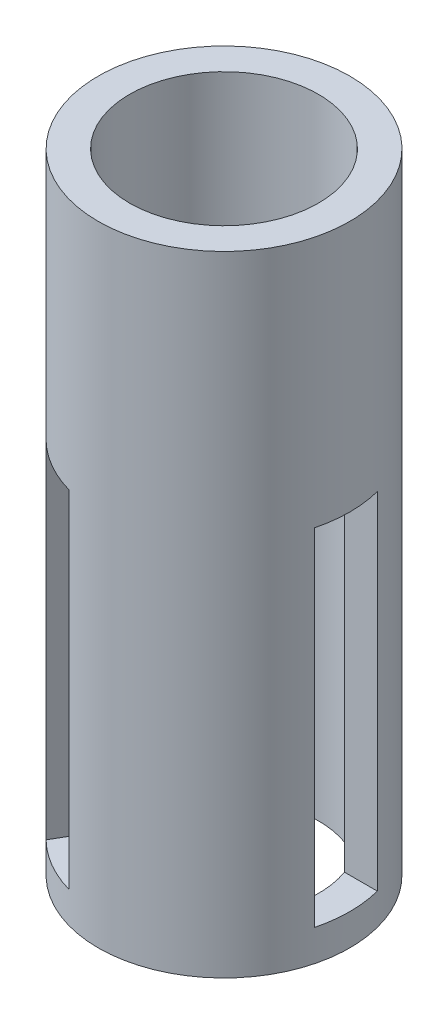
ISO-10303-21;
HEADER;
FILE_DESCRIPTION(('STEP AP214'),'2;1');
FILE_NAME('part.step','',(''),(''),'','','');
FILE_SCHEMA(('AUTOMOTIVE_DESIGN { 1 0 10303 214 1 1 1 1 }'));
ENDSEC;
DATA;
#1=APPLICATION_CONTEXT('core data for automotive mechanical design processes');
#2=APPLICATION_PROTOCOL_DEFINITION('international standard','automotive_design',2000,#1);
#3=PRODUCT_CONTEXT('',#1,'mechanical');
#4=PRODUCT('Part','Part','',(#3));
#5=PRODUCT_RELATED_PRODUCT_CATEGORY('part','',(#4));
#6=PRODUCT_DEFINITION_FORMATION('','',#4);
#7=PRODUCT_DEFINITION_CONTEXT('part definition',#1,'design');
#8=PRODUCT_DEFINITION('design','',#6,#7);
#9=PRODUCT_DEFINITION_SHAPE('','',#8);
#10=(LENGTH_UNIT() NAMED_UNIT(*) SI_UNIT(.MILLI.,.METRE.));
#11=(NAMED_UNIT(*) PLANE_ANGLE_UNIT() SI_UNIT($,.RADIAN.));
#12=(NAMED_UNIT(*) SI_UNIT($,.STERADIAN.) SOLID_ANGLE_UNIT());
#13=UNCERTAINTY_MEASURE_WITH_UNIT(LENGTH_MEASURE(1.E-05),#10,'distance_accuracy_value','');
#14=(GEOMETRIC_REPRESENTATION_CONTEXT(3) GLOBAL_UNCERTAINTY_ASSIGNED_CONTEXT((#13)) GLOBAL_UNIT_ASSIGNED_CONTEXT((#10,
#11,#12)) REPRESENTATION_CONTEXT('',''));
#15=CARTESIAN_POINT('',(0.,0.,0.));
#16=DIRECTION('',(0.,0.,1.));
#17=DIRECTION('',(1.,0.,0.));
#18=AXIS2_PLACEMENT_3D('',#15,#16,#17);
#19=CARTESIAN_POINT('',(0.,100.,0.));
#20=DIRECTION('',(0.,1.,0.));
#21=DIRECTION('',(0.,0.,1.));
#22=AXIS2_PLACEMENT_3D('',#19,#20,#21);
#23=PLANE('',#22);
#24=CARTESIAN_POINT('',(0.,100.,0.));
#25=DIRECTION('',(0.,1.,0.));
#26=DIRECTION('',(0.,0.,1.));
#27=AXIS2_PLACEMENT_3D('',#24,#25,#26);
#28=CIRCLE('',#27,20.);
#29=CARTESIAN_POINT('',(0.,100.,20.));
#30=VERTEX_POINT('',#29);
#31=EDGE_CURVE('E11',#30,#30,#28,.T.);
#32=ORIENTED_EDGE('',*,*,#31,.T.);
#33=EDGE_LOOP('',(#32));
#34=FACE_BOUND('',#33,.T.);
#35=CARTESIAN_POINT('',(0.,100.,0.));
#36=DIRECTION('',(0.,1.,0.));
#37=DIRECTION('',(0.,0.,1.));
#38=AXIS2_PLACEMENT_3D('',#35,#36,#37);
#39=CIRCLE('',#38,15.);
#40=CARTESIAN_POINT('',(0.,100.,15.));
#41=VERTEX_POINT('',#40);
#42=EDGE_CURVE('E274',#41,#41,#39,.T.);
#43=ORIENTED_EDGE('',*,*,#42,.F.);
#44=EDGE_LOOP('',(#43));
#45=FACE_BOUND('',#44,.T.);
#46=ADVANCED_FACE('F41',(#34,#45),#23,.T.);
#47=CARTESIAN_POINT('',(0.,0.,0.));
#48=DIRECTION('',(0.,1.,0.));
#49=DIRECTION('',(0.,0.,1.));
#50=AXIS2_PLACEMENT_3D('',#47,#48,#49);
#51=PLANE('',#50);
#52=CARTESIAN_POINT('',(0.,0.,0.));
#53=DIRECTION('',(0.,1.,0.));
#54=DIRECTION('',(0.,0.,1.));
#55=AXIS2_PLACEMENT_3D('',#52,#53,#54);
#56=CIRCLE('',#55,20.);
#57=CARTESIAN_POINT('',(0.,0.,20.));
#58=VERTEX_POINT('',#57);
#59=EDGE_CURVE('E45',#58,#58,#56,.T.);
#60=ORIENTED_EDGE('',*,*,#59,.F.);
#61=EDGE_LOOP('',(#60));
#62=FACE_BOUND('',#61,.T.);
#63=CARTESIAN_POINT('',(0.,0.,0.));
#64=DIRECTION('',(0.,1.,0.));
#65=DIRECTION('',(0.,0.,1.));
#66=AXIS2_PLACEMENT_3D('',#63,#64,#65);
#67=CIRCLE('',#66,15.);
#68=CARTESIAN_POINT('',(0.,0.,15.));
#69=VERTEX_POINT('',#68);
#70=EDGE_CURVE('E273',#69,#69,#67,.T.);
#71=ORIENTED_EDGE('',*,*,#70,.T.);
#72=EDGE_LOOP('',(#71));
#73=FACE_BOUND('',#72,.T.);
#74=ADVANCED_FACE('F282',(#62,#73),#51,.F.);
#75=CARTESIAN_POINT('',(0.,100.,0.));
#76=DIRECTION('',(0.,-1.,0.));
#77=DIRECTION('',(0.,0.,-1.));
#78=AXIS2_PLACEMENT_3D('',#75,#76,#77);
#79=CYLINDRICAL_SURFACE('',#78,20.);
#80=CARTESIAN_POINT('',(0.,60.,0.));
#81=DIRECTION('',(0.,1.,0.));
#82=DIRECTION('',(0.,0.,1.));
#83=AXIS2_PLACEMENT_3D('',#80,#81,#82);
#84=CIRCLE('',#83,20.);
#85=CARTESIAN_POINT('',(-14.0125853844408,60.,14.2705098312484));
#86=VERTEX_POINT('',#85);
#87=CARTESIAN_POINT('',(-5.35233134659644,60.,19.2705098312484));
#88=VERTEX_POINT('',#87);
#89=EDGE_CURVE('E220',#86,#88,#84,.T.);
#90=ORIENTED_EDGE('',*,*,#89,.T.);
#91=DIRECTION('',(0.,-1.,0.));
#92=VECTOR('',#91,1.);
#93=CARTESIAN_POINT('',(-5.35233134659644,100.,19.2705098312484));
#94=LINE('',#93,#92);
#95=CARTESIAN_POINT('',(-5.35233134659644,5.,19.2705098312484));
#96=VERTEX_POINT('',#95);
#97=EDGE_CURVE('E223',#88,#96,#94,.T.);
#98=ORIENTED_EDGE('',*,*,#97,.T.);
#99=CARTESIAN_POINT('',(0.,5.,0.));
#100=DIRECTION('',(0.,-1.,0.));
#101=DIRECTION('',(1.,0.,0.));
#102=AXIS2_PLACEMENT_3D('',#99,#100,#101);
#103=CIRCLE('',#102,20.);
#104=CARTESIAN_POINT('',(-14.0125853844408,5.,14.2705098312484));
#105=VERTEX_POINT('',#104);
#106=EDGE_CURVE('E153',#96,#105,#103,.T.);
#107=ORIENTED_EDGE('',*,*,#106,.T.);
#108=DIRECTION('',(0.,-1.,0.));
#109=VECTOR('',#108,1.);
#110=CARTESIAN_POINT('',(-14.0125853844408,100.,14.2705098312484));
#111=LINE('',#110,#109);
#112=EDGE_CURVE('E216',#105,#86,#111,.F.);
#113=ORIENTED_EDGE('',*,*,#112,.T.);
#114=EDGE_LOOP('',(#90,#98,#107,#113));
#115=FACE_BOUND('',#114,.T.);
#116=DIRECTION('',(0.,-1.,0.));
#117=VECTOR('',#116,1.);
#118=CARTESIAN_POINT('',(-14.0125853844406,100.,-14.2705098312486));
#119=LINE('',#118,#117);
#120=CARTESIAN_POINT('',(-14.0125853844406,60.,-14.2705098312485));
#121=VERTEX_POINT('',#120);
#122=CARTESIAN_POINT('',(-14.0125853844406,5.,-14.2705098312486));
#123=VERTEX_POINT('',#122);
#124=EDGE_CURVE('E207',#121,#123,#119,.T.);
#125=ORIENTED_EDGE('',*,*,#124,.T.);
#126=CARTESIAN_POINT('',(0.,5.,0.));
#127=DIRECTION('',(0.,-1.,0.));
#128=DIRECTION('',(1.,0.,0.));
#129=AXIS2_PLACEMENT_3D('',#126,#127,#128);
#130=CIRCLE('',#129,20.);
#131=CARTESIAN_POINT('',(-5.35233134659616,5.,-19.2705098312485));
#132=VERTEX_POINT('',#131);
#133=EDGE_CURVE('E65',#123,#132,#130,.T.);
#134=ORIENTED_EDGE('',*,*,#133,.T.);
#135=DIRECTION('',(0.,-1.,0.));
#136=VECTOR('',#135,1.);
#137=CARTESIAN_POINT('',(-5.35233134659617,100.,-19.2705098312485));
#138=LINE('',#137,#136);
#139=CARTESIAN_POINT('',(-5.35233134659617,60.,-19.2705098312485));
#140=VERTEX_POINT('',#139);
#141=EDGE_CURVE('E213',#132,#140,#138,.F.);
#142=ORIENTED_EDGE('',*,*,#141,.T.);
#143=CARTESIAN_POINT('',(0.,60.,0.));
#144=DIRECTION('',(0.,1.,0.));
#145=DIRECTION('',(0.,0.,1.));
#146=AXIS2_PLACEMENT_3D('',#143,#144,#145);
#147=CIRCLE('',#146,20.);
#148=EDGE_CURVE('E210',#140,#121,#147,.T.);
#149=ORIENTED_EDGE('',*,*,#148,.T.);
#150=EDGE_LOOP('',(#125,#134,#142,#149));
#151=FACE_BOUND('',#150,.T.);
#152=CARTESIAN_POINT('',(0.,60.,0.));
#153=DIRECTION('',(0.,1.,0.));
#154=DIRECTION('',(0.,0.,1.));
#155=AXIS2_PLACEMENT_3D('',#152,#153,#154);
#156=CIRCLE('',#155,20.);
#157=CARTESIAN_POINT('',(19.3649167310371,60.,5.));
#158=VERTEX_POINT('',#157);
#159=CARTESIAN_POINT('',(19.3649167310371,60.,-5.));
#160=VERTEX_POINT('',#159);
#161=EDGE_CURVE('E263',#158,#160,#156,.T.);
#162=ORIENTED_EDGE('',*,*,#161,.T.);
#163=DIRECTION('',(0.,-1.,0.));
#164=VECTOR('',#163,1.);
#165=CARTESIAN_POINT('',(19.3649167310371,100.,-5.));
#166=LINE('',#165,#164);
#167=CARTESIAN_POINT('',(19.3649167310371,5.,-4.99999999999999));
#168=VERTEX_POINT('',#167);
#169=EDGE_CURVE('E266',#160,#168,#166,.T.);
#170=ORIENTED_EDGE('',*,*,#169,.T.);
#171=CARTESIAN_POINT('',(0.,5.,0.));
#172=DIRECTION('',(0.,-1.,0.));
#173=DIRECTION('',(0.,0.,-1.));
#174=AXIS2_PLACEMENT_3D('',#171,#172,#173);
#175=CIRCLE('',#174,20.);
#176=CARTESIAN_POINT('',(19.3649167310371,5.,5.00000000000001));
#177=VERTEX_POINT('',#176);
#178=EDGE_CURVE('E270',#168,#177,#175,.T.);
#179=ORIENTED_EDGE('',*,*,#178,.T.);
#180=DIRECTION('',(0.,-1.,0.));
#181=VECTOR('',#180,1.);
#182=CARTESIAN_POINT('',(19.3649167310371,100.,5.));
#183=LINE('',#182,#181);
#184=EDGE_CURVE('E251',#177,#158,#183,.F.);
#185=ORIENTED_EDGE('',*,*,#184,.T.);
#186=EDGE_LOOP('',(#162,#170,#179,#185));
#187=FACE_BOUND('',#186,.T.);
#188=ORIENTED_EDGE('',*,*,#31,.F.);
#189=EDGE_LOOP('',(#188));
#190=FACE_BOUND('',#189,.T.);
#191=ORIENTED_EDGE('',*,*,#59,.T.);
#192=EDGE_LOOP('',(#191));
#193=FACE_BOUND('',#192,.T.);
#194=ADVANCED_FACE('F43',(#115,#151,#187,#190,#193),#79,.T.);
#195=CARTESIAN_POINT('',(0.,100.,0.));
#196=DIRECTION('',(0.,-1.,0.));
#197=DIRECTION('',(0.,0.,-1.));
#198=AXIS2_PLACEMENT_3D('',#195,#196,#197);
#199=CYLINDRICAL_SURFACE('',#198,15.);
#200=CARTESIAN_POINT('',(0.,5.,0.));
#201=DIRECTION('',(0.,-1.,0.));
#202=DIRECTION('',(1.,0.,0.));
#203=AXIS2_PLACEMENT_3D('',#200,#201,#202);
#204=CIRCLE('',#203,15.);
#205=CARTESIAN_POINT('',(-11.4011948307877,5.,9.74744871391584));
#206=VERTEX_POINT('',#205);
#207=CARTESIAN_POINT('',(-2.74094079294335,5.,14.7474487139159));
#208=VERTEX_POINT('',#207);
#209=EDGE_CURVE('E151',#206,#208,#204,.F.);
#210=ORIENTED_EDGE('',*,*,#209,.T.);
#211=DIRECTION('',(0.,-1.,0.));
#212=VECTOR('',#211,1.);
#213=CARTESIAN_POINT('',(-2.74094079294335,100.,14.7474487139159));
#214=LINE('',#213,#212);
#215=CARTESIAN_POINT('',(-2.74094079294335,60.,14.7474487139159));
#216=VERTEX_POINT('',#215);
#217=EDGE_CURVE('E134',#208,#216,#214,.F.);
#218=ORIENTED_EDGE('',*,*,#217,.T.);
#219=CARTESIAN_POINT('',(0.,60.,0.));
#220=DIRECTION('',(0.,1.,0.));
#221=DIRECTION('',(0.,0.,1.));
#222=AXIS2_PLACEMENT_3D('',#219,#220,#221);
#223=CIRCLE('',#222,15.);
#224=CARTESIAN_POINT('',(-11.4011948307877,60.,9.74744871391584));
#225=VERTEX_POINT('',#224);
#226=EDGE_CURVE('E170',#216,#225,#223,.F.);
#227=ORIENTED_EDGE('',*,*,#226,.T.);
#228=DIRECTION('',(0.,-1.,0.));
#229=VECTOR('',#228,1.);
#230=CARTESIAN_POINT('',(-11.4011948307877,100.,9.74744871391584));
#231=LINE('',#230,#229);
#232=EDGE_CURVE('E158',#225,#206,#231,.T.);
#233=ORIENTED_EDGE('',*,*,#232,.T.);
#234=EDGE_LOOP('',(#210,#218,#227,#233));
#235=FACE_BOUND('',#234,.T.);
#236=DIRECTION('',(0.,-1.,0.));
#237=VECTOR('',#236,1.);
#238=CARTESIAN_POINT('',(-2.74094079294314,100.,-14.7474487139159));
#239=LINE('',#238,#237);
#240=CARTESIAN_POINT('',(-2.74094079294314,60.,-14.7474487139159));
#241=VERTEX_POINT('',#240);
#242=CARTESIAN_POINT('',(-2.74094079294314,5.,-14.7474487139159));
#243=VERTEX_POINT('',#242);
#244=EDGE_CURVE('E179',#241,#243,#239,.T.);
#245=ORIENTED_EDGE('',*,*,#244,.T.);
#246=CARTESIAN_POINT('',(0.,5.,0.));
#247=DIRECTION('',(0.,-1.,0.));
#248=DIRECTION('',(1.,0.,0.));
#249=AXIS2_PLACEMENT_3D('',#246,#247,#248);
#250=CIRCLE('',#249,15.);
#251=CARTESIAN_POINT('',(-11.4011948307876,5.,-9.747448713916));
#252=VERTEX_POINT('',#251);
#253=EDGE_CURVE('E164',#243,#252,#250,.F.);
#254=ORIENTED_EDGE('',*,*,#253,.T.);
#255=DIRECTION('',(0.,-1.,0.));
#256=VECTOR('',#255,1.);
#257=CARTESIAN_POINT('',(-11.4011948307876,100.,-9.747448713916));
#258=LINE('',#257,#256);
#259=CARTESIAN_POINT('',(-11.4011948307876,60.,-9.747448713916));
#260=VERTEX_POINT('',#259);
#261=EDGE_CURVE('E184',#252,#260,#258,.F.);
#262=ORIENTED_EDGE('',*,*,#261,.T.);
#263=CARTESIAN_POINT('',(0.,60.,0.));
#264=DIRECTION('',(0.,1.,0.));
#265=DIRECTION('',(0.,0.,1.));
#266=AXIS2_PLACEMENT_3D('',#263,#264,#265);
#267=CIRCLE('',#266,15.);
#268=EDGE_CURVE('E192',#260,#241,#267,.F.);
#269=ORIENTED_EDGE('',*,*,#268,.T.);
#270=EDGE_LOOP('',(#245,#254,#262,#269));
#271=FACE_BOUND('',#270,.T.);
#272=CARTESIAN_POINT('',(0.,5.,0.));
#273=DIRECTION('',(0.,-1.,0.));
#274=DIRECTION('',(0.,0.,-1.));
#275=AXIS2_PLACEMENT_3D('',#272,#273,#274);
#276=CIRCLE('',#275,15.);
#277=CARTESIAN_POINT('',(14.142135623731,5.,5.));
#278=VERTEX_POINT('',#277);
#279=CARTESIAN_POINT('',(14.142135623731,5.,-4.99999999999999));
#280=VERTEX_POINT('',#279);
#281=EDGE_CURVE('E228',#278,#280,#276,.F.);
#282=ORIENTED_EDGE('',*,*,#281,.T.);
#283=DIRECTION('',(0.,-1.,0.));
#284=VECTOR('',#283,1.);
#285=CARTESIAN_POINT('',(14.142135623731,100.,-5.));
#286=LINE('',#285,#284);
#287=CARTESIAN_POINT('',(14.142135623731,60.,-5.));
#288=VERTEX_POINT('',#287);
#289=EDGE_CURVE('E244',#280,#288,#286,.F.);
#290=ORIENTED_EDGE('',*,*,#289,.T.);
#291=CARTESIAN_POINT('',(0.,60.,0.));
#292=DIRECTION('',(0.,1.,0.));
#293=DIRECTION('',(0.,0.,1.));
#294=AXIS2_PLACEMENT_3D('',#291,#292,#293);
#295=CIRCLE('',#294,15.);
#296=CARTESIAN_POINT('',(14.1421356237309,60.,5.));
#297=VERTEX_POINT('',#296);
#298=EDGE_CURVE('E239',#288,#297,#295,.F.);
#299=ORIENTED_EDGE('',*,*,#298,.T.);
#300=DIRECTION('',(0.,-1.,0.));
#301=VECTOR('',#300,1.);
#302=CARTESIAN_POINT('',(14.142135623731,100.,5.));
#303=LINE('',#302,#301);
#304=EDGE_CURVE('E233',#297,#278,#303,.T.);
#305=ORIENTED_EDGE('',*,*,#304,.T.);
#306=EDGE_LOOP('',(#282,#290,#299,#305));
#307=FACE_BOUND('',#306,.T.);
#308=ORIENTED_EDGE('',*,*,#42,.T.);
#309=EDGE_LOOP('',(#308));
#310=FACE_BOUND('',#309,.T.);
#311=ORIENTED_EDGE('',*,*,#70,.F.);
#312=EDGE_LOOP('',(#311));
#313=FACE_BOUND('',#312,.T.);
#314=ADVANCED_FACE('F156',(#235,#271,#307,#310,#313),#199,.F.);
#315=CARTESIAN_POINT('',(-20.001,5.,-4.99999999999999));
#316=DIRECTION('',(0.,-1.,0.));
#317=DIRECTION('',(0.,0.,-1.));
#318=AXIS2_PLACEMENT_3D('',#315,#316,#317);
#319=PLANE('',#318);
#320=DIRECTION('',(1.,0.,0.));
#321=VECTOR('',#320,1.);
#322=CARTESIAN_POINT('',(-20.001,5.,-4.99999999999999));
#323=LINE('',#322,#321);
#324=EDGE_CURVE('E232',#280,#168,#323,.T.);
#325=ORIENTED_EDGE('',*,*,#324,.F.);
#326=ORIENTED_EDGE('',*,*,#281,.F.);
#327=DIRECTION('',(1.,0.,0.));
#328=VECTOR('',#327,1.);
#329=CARTESIAN_POINT('',(-20.001,5.,5.00000000000001));
#330=LINE('',#329,#328);
#331=EDGE_CURVE('E237',#278,#177,#330,.T.);
#332=ORIENTED_EDGE('',*,*,#331,.T.);
#333=ORIENTED_EDGE('',*,*,#178,.F.);
#334=EDGE_LOOP('',(#325,#326,#332,#333));
#335=FACE_BOUND('',#334,.T.);
#336=ADVANCED_FACE('F285',(#335),#319,.F.);
#337=CARTESIAN_POINT('',(-20.001,5.,-4.99999999999999));
#338=DIRECTION('',(0.,0.,-1.));
#339=DIRECTION('',(0.,1.,0.));
#340=AXIS2_PLACEMENT_3D('',#337,#338,#339);
#341=PLANE('',#340);
#342=DIRECTION('',(1.,0.,0.));
#343=VECTOR('',#342,1.);
#344=CARTESIAN_POINT('',(-20.001,60.,-5.));
#345=LINE('',#344,#343);
#346=EDGE_CURVE('E243',#288,#160,#345,.T.);
#347=ORIENTED_EDGE('',*,*,#346,.F.);
#348=ORIENTED_EDGE('',*,*,#289,.F.);
#349=ORIENTED_EDGE('',*,*,#324,.T.);
#350=ORIENTED_EDGE('',*,*,#169,.F.);
#351=EDGE_LOOP('',(#347,#348,#349,#350));
#352=FACE_BOUND('',#351,.T.);
#353=ADVANCED_FACE('F291',(#352),#341,.F.);
#354=CARTESIAN_POINT('',(-20.001,60.,-5.));
#355=DIRECTION('',(0.,1.,0.));
#356=DIRECTION('',(0.,0.,1.));
#357=AXIS2_PLACEMENT_3D('',#354,#355,#356);
#358=PLANE('',#357);
#359=DIRECTION('',(1.,0.,0.));
#360=VECTOR('',#359,1.);
#361=CARTESIAN_POINT('',(-20.001,60.,5.));
#362=LINE('',#361,#360);
#363=EDGE_CURVE('E238',#297,#158,#362,.T.);
#364=ORIENTED_EDGE('',*,*,#363,.F.);
#365=ORIENTED_EDGE('',*,*,#298,.F.);
#366=ORIENTED_EDGE('',*,*,#346,.T.);
#367=ORIENTED_EDGE('',*,*,#161,.F.);
#368=EDGE_LOOP('',(#364,#365,#366,#367));
#369=FACE_BOUND('',#368,.T.);
#370=ADVANCED_FACE('F411',(#369),#358,.F.);
#371=CARTESIAN_POINT('',(-20.001,5.,5.00000000000001));
#372=DIRECTION('',(0.,0.,1.));
#373=DIRECTION('',(0.,-1.,0.));
#374=AXIS2_PLACEMENT_3D('',#371,#372,#373);
#375=PLANE('',#374);
#376=ORIENTED_EDGE('',*,*,#331,.F.);
#377=ORIENTED_EDGE('',*,*,#304,.F.);
#378=ORIENTED_EDGE('',*,*,#363,.T.);
#379=ORIENTED_EDGE('',*,*,#184,.F.);
#380=EDGE_LOOP('',(#376,#377,#378,#379));
#381=FACE_BOUND('',#380,.T.);
#382=ADVANCED_FACE('F325',(#381),#375,.F.);
#383=CARTESIAN_POINT('',(17.9910640694683,5.,21.1614370505464));
#384=DIRECTION('',(0.866025403784443,0.,-0.499999999999992));
#385=DIRECTION('',(-0.499999999999992,0.,-0.866025403784443));
#386=AXIS2_PLACEMENT_3D('',#383,#384,#385);
#387=PLANE('',#386);
#388=DIRECTION('',(-0.499999999999992,0.,-0.866025403784443));
#389=VECTOR('',#388,1.);
#390=CARTESIAN_POINT('',(17.9910640694683,5.,21.1614370505464));
#391=LINE('',#390,#389);
#392=EDGE_CURVE('E183',#243,#132,#391,.T.);
#393=ORIENTED_EDGE('',*,*,#392,.F.);
#394=ORIENTED_EDGE('',*,*,#244,.F.);
#395=DIRECTION('',(-0.499999999999992,0.,-0.866025403784443));
#396=VECTOR('',#395,1.);
#397=CARTESIAN_POINT('',(17.9910640694682,60.,21.1614370505464));
#398=LINE('',#397,#396);
#399=EDGE_CURVE('E189',#241,#140,#398,.T.);
#400=ORIENTED_EDGE('',*,*,#399,.T.);
#401=ORIENTED_EDGE('',*,*,#141,.F.);
#402=EDGE_LOOP('',(#393,#394,#400,#401));
#403=FACE_BOUND('',#402,.T.);
#404=ADVANCED_FACE('F335',(#403),#387,.F.);
#405=CARTESIAN_POINT('',(9.33081003162381,60.,26.1614370505463));
#406=DIRECTION('',(0.,1.,0.));
#407=DIRECTION('',(0.,0.,1.));
#408=AXIS2_PLACEMENT_3D('',#405,#406,#407);
#409=PLANE('',#408);
#410=ORIENTED_EDGE('',*,*,#399,.F.);
#411=ORIENTED_EDGE('',*,*,#268,.F.);
#412=DIRECTION('',(-0.499999999999992,0.,-0.866025403784443));
#413=VECTOR('',#412,1.);
#414=CARTESIAN_POINT('',(9.33081003162381,60.,26.1614370505463));
#415=LINE('',#414,#413);
#416=EDGE_CURVE('E188',#260,#121,#415,.T.);
#417=ORIENTED_EDGE('',*,*,#416,.T.);
#418=ORIENTED_EDGE('',*,*,#148,.F.);
#419=EDGE_LOOP('',(#410,#411,#417,#418));
#420=FACE_BOUND('',#419,.T.);
#421=ADVANCED_FACE('F340',(#420),#409,.F.);
#422=CARTESIAN_POINT('',(9.33081003162382,5.,26.1614370505463));
#423=DIRECTION('',(-0.866025403784443,0.,0.499999999999992));
#424=DIRECTION('',(0.499999999999992,0.,0.866025403784443));
#425=AXIS2_PLACEMENT_3D('',#422,#423,#424);
#426=PLANE('',#425);
#427=ORIENTED_EDGE('',*,*,#416,.F.);
#428=ORIENTED_EDGE('',*,*,#261,.F.);
#429=DIRECTION('',(-0.499999999999992,0.,-0.866025403784443));
#430=VECTOR('',#429,1.);
#431=CARTESIAN_POINT('',(9.33081003162382,5.,26.1614370505463));
#432=LINE('',#431,#430);
#433=EDGE_CURVE('E160',#252,#123,#432,.T.);
#434=ORIENTED_EDGE('',*,*,#433,.T.);
#435=ORIENTED_EDGE('',*,*,#124,.F.);
#436=EDGE_LOOP('',(#427,#428,#434,#435));
#437=FACE_BOUND('',#436,.T.);
#438=ADVANCED_FACE('F350',(#437),#426,.F.);
#439=CARTESIAN_POINT('',(9.33081003162382,5.,26.1614370505463));
#440=DIRECTION('',(0.,-1.,0.));
#441=DIRECTION('',(1.,0.,0.));
#442=AXIS2_PLACEMENT_3D('',#439,#440,#441);
#443=PLANE('',#442);
#444=ORIENTED_EDGE('',*,*,#433,.F.);
#445=ORIENTED_EDGE('',*,*,#253,.F.);
#446=ORIENTED_EDGE('',*,*,#392,.T.);
#447=ORIENTED_EDGE('',*,*,#133,.F.);
#448=EDGE_LOOP('',(#444,#445,#446,#447));
#449=FACE_BOUND('',#448,.T.);
#450=ADVANCED_FACE('F360',(#449),#443,.F.);
#451=CARTESIAN_POINT('',(17.9910640694686,5.,-21.1614370505462));
#452=DIRECTION('',(0.,-1.,0.));
#453=DIRECTION('',(1.,0.,0.));
#454=AXIS2_PLACEMENT_3D('',#451,#452,#453);
#455=PLANE('',#454);
#456=DIRECTION('',(-0.500000000000004,0.,0.866025403784436));
#457=VECTOR('',#456,1.);
#458=CARTESIAN_POINT('',(17.9910640694686,5.,-21.1614370505462));
#459=LINE('',#458,#457);
#460=EDGE_CURVE('E138',#208,#96,#459,.T.);
#461=ORIENTED_EDGE('',*,*,#460,.F.);
#462=ORIENTED_EDGE('',*,*,#209,.F.);
#463=DIRECTION('',(-0.500000000000004,0.,0.866025403784436));
#464=VECTOR('',#463,1.);
#465=CARTESIAN_POINT('',(9.33081003162422,5.,-26.1614370505463));
#466=LINE('',#465,#464);
#467=EDGE_CURVE('E169',#206,#105,#466,.T.);
#468=ORIENTED_EDGE('',*,*,#467,.T.);
#469=ORIENTED_EDGE('',*,*,#106,.F.);
#470=EDGE_LOOP('',(#461,#462,#468,#469));
#471=FACE_BOUND('',#470,.T.);
#472=ADVANCED_FACE('F149',(#471),#455,.F.);
#473=CARTESIAN_POINT('',(17.9910640694686,5.,-21.1614370505462));
#474=DIRECTION('',(0.866025403784436,0.,0.500000000000004));
#475=DIRECTION('',(0.500000000000004,0.,-0.866025403784436));
#476=AXIS2_PLACEMENT_3D('',#473,#474,#475);
#477=PLANE('',#476);
#478=DIRECTION('',(-0.500000000000004,0.,0.866025403784436));
#479=VECTOR('',#478,1.);
#480=CARTESIAN_POINT('',(17.9910640694686,60.,-21.1614370505462));
#481=LINE('',#480,#479);
#482=EDGE_CURVE('E141',#216,#88,#481,.T.);
#483=ORIENTED_EDGE('',*,*,#482,.F.);
#484=ORIENTED_EDGE('',*,*,#217,.F.);
#485=ORIENTED_EDGE('',*,*,#460,.T.);
#486=ORIENTED_EDGE('',*,*,#97,.F.);
#487=EDGE_LOOP('',(#483,#484,#485,#486));
#488=FACE_BOUND('',#487,.T.);
#489=ADVANCED_FACE('F136',(#488),#477,.F.);
#490=CARTESIAN_POINT('',(17.9910640694686,60.,-21.1614370505462));
#491=DIRECTION('',(0.,1.,0.));
#492=DIRECTION('',(0.,0.,1.));
#493=AXIS2_PLACEMENT_3D('',#490,#491,#492);
#494=PLANE('',#493);
#495=DIRECTION('',(-0.500000000000004,0.,0.866025403784436));
#496=VECTOR('',#495,1.);
#497=CARTESIAN_POINT('',(9.33081003162422,60.,-26.1614370505463));
#498=LINE('',#497,#496);
#499=EDGE_CURVE('E57',#225,#86,#498,.T.);
#500=ORIENTED_EDGE('',*,*,#499,.F.);
#501=ORIENTED_EDGE('',*,*,#226,.F.);
#502=ORIENTED_EDGE('',*,*,#482,.T.);
#503=ORIENTED_EDGE('',*,*,#89,.F.);
#504=EDGE_LOOP('',(#500,#501,#502,#503));
#505=FACE_BOUND('',#504,.T.);
#506=ADVANCED_FACE('F387',(#505),#494,.F.);
#507=CARTESIAN_POINT('',(9.33081003162422,5.,-26.1614370505463));
#508=DIRECTION('',(-0.866025403784436,0.,-0.500000000000004));
#509=DIRECTION('',(-0.500000000000004,0.,0.866025403784436));
#510=AXIS2_PLACEMENT_3D('',#507,#508,#509);
#511=PLANE('',#510);
#512=ORIENTED_EDGE('',*,*,#467,.F.);
#513=ORIENTED_EDGE('',*,*,#232,.F.);
#514=ORIENTED_EDGE('',*,*,#499,.T.);
#515=ORIENTED_EDGE('',*,*,#112,.F.);
#516=EDGE_LOOP('',(#512,#513,#514,#515));
#517=FACE_BOUND('',#516,.T.);
#518=ADVANCED_FACE('F396',(#517),#511,.F.);
#519=CLOSED_SHELL('',(#46,#74,#194,#314,#336,#353,#370,#382,#404,#421,#438,#450,#472,#489,#506,#518));
#520=MANIFOLD_SOLID_BREP('B2',#519);
#521=ADVANCED_BREP_SHAPE_REPRESENTATION('',(#18,#520),#14);
#522=SHAPE_DEFINITION_REPRESENTATION(#9,#521);
ENDSEC;
END-ISO-10303-21;
